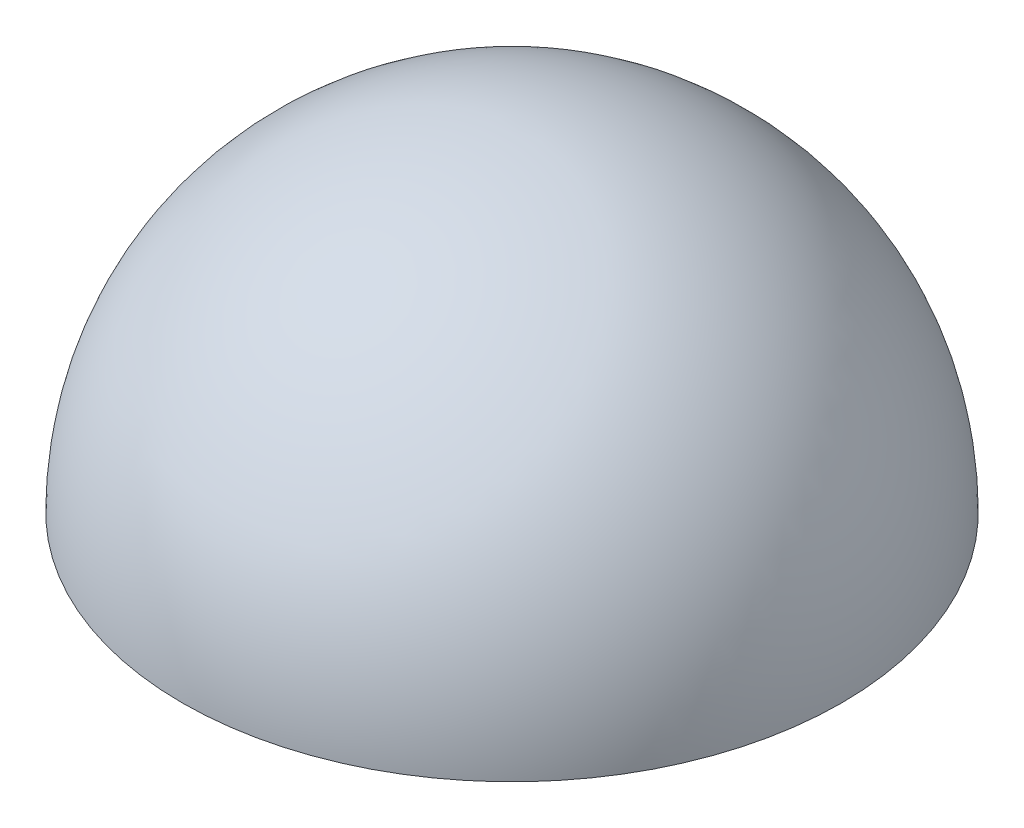
ISO-10303-21;
HEADER;
FILE_DESCRIPTION(('STEP AP214'),'2;1');
FILE_NAME('part.step','',(''),(''),'','','');
FILE_SCHEMA(('AUTOMOTIVE_DESIGN { 1 0 10303 214 1 1 1 1 }'));
ENDSEC;
DATA;
#1=APPLICATION_CONTEXT('core data for automotive mechanical design processes');
#2=APPLICATION_PROTOCOL_DEFINITION('international standard','automotive_design',2000,#1);
#3=PRODUCT_CONTEXT('',#1,'mechanical');
#4=PRODUCT('Part','Part','',(#3));
#5=PRODUCT_RELATED_PRODUCT_CATEGORY('part','',(#4));
#6=PRODUCT_DEFINITION_FORMATION('','',#4);
#7=PRODUCT_DEFINITION_CONTEXT('part definition',#1,'design');
#8=PRODUCT_DEFINITION('design','',#6,#7);
#9=PRODUCT_DEFINITION_SHAPE('','',#8);
#10=(LENGTH_UNIT() NAMED_UNIT(*) SI_UNIT(.MILLI.,.METRE.));
#11=(NAMED_UNIT(*) PLANE_ANGLE_UNIT() SI_UNIT($,.RADIAN.));
#12=(NAMED_UNIT(*) SI_UNIT($,.STERADIAN.) SOLID_ANGLE_UNIT());
#13=UNCERTAINTY_MEASURE_WITH_UNIT(LENGTH_MEASURE(1.E-05),#10,'distance_accuracy_value','');
#14=(GEOMETRIC_REPRESENTATION_CONTEXT(3) GLOBAL_UNCERTAINTY_ASSIGNED_CONTEXT((#13)) GLOBAL_UNIT_ASSIGNED_CONTEXT((#10,
#11,#12)) REPRESENTATION_CONTEXT('',''));
#15=CARTESIAN_POINT('',(0.,0.,0.));
#16=DIRECTION('',(0.,0.,1.));
#17=DIRECTION('',(1.,0.,0.));
#18=AXIS2_PLACEMENT_3D('',#15,#16,#17);
#19=CARTESIAN_POINT('',(0.,0.,0.));
#20=DIRECTION('',(0.,-1.,0.));
#21=DIRECTION('',(-1.,0.,0.));
#22=AXIS2_PLACEMENT_3D('',#19,#20,#21);
#23=SPHERICAL_SURFACE('',#22,84.25);
#24=CARTESIAN_POINT('',(0.,-5.88314605595068E-13,0.));
#25=DIRECTION('',(0.,-1.,0.));
#26=DIRECTION('',(0.,0.,-1.));
#27=AXIS2_PLACEMENT_3D('',#24,#25,#26);
#28=CIRCLE('',#27,84.25);
#29=CARTESIAN_POINT('',(0.,-5.88314605595068E-13,-84.25));
#30=VERTEX_POINT('',#29);
#31=EDGE_CURVE('E10',#30,#30,#28,.T.);
#32=ORIENTED_EDGE('',*,*,#31,.F.);
#33=EDGE_LOOP('',(#32));
#34=FACE_BOUND('',#33,.T.);
#35=ADVANCED_FACE('F41',(#34),#23,.T.);
#36=CARTESIAN_POINT('',(-84.25,-5.62128495553745E-13,0.));
#37=DIRECTION('',(0.,1.,0.));
#38=DIRECTION('',(0.,0.,1.));
#39=AXIS2_PLACEMENT_3D('',#36,#37,#38);
#40=PLANE('',#39);
#41=CARTESIAN_POINT('',(0.,-5.35942385512421E-13,0.));
#42=DIRECTION('',(0.,-1.,0.));
#43=DIRECTION('',(0.,0.,-1.));
#44=AXIS2_PLACEMENT_3D('',#41,#42,#43);
#45=CIRCLE('',#44,76.75);
#46=CARTESIAN_POINT('',(0.,-5.35942385512421E-13,-76.75));
#47=VERTEX_POINT('',#46);
#48=EDGE_CURVE('E47',#47,#47,#45,.T.);
#49=ORIENTED_EDGE('',*,*,#48,.F.);
#50=EDGE_LOOP('',(#49));
#51=FACE_BOUND('',#50,.T.);
#52=ORIENTED_EDGE('',*,*,#31,.T.);
#53=EDGE_LOOP('',(#52));
#54=FACE_BOUND('',#53,.T.);
#55=ADVANCED_FACE('F55',(#51,#54),#40,.F.);
#56=CARTESIAN_POINT('',(0.,0.,0.));
#57=DIRECTION('',(0.,-1.,0.));
#58=DIRECTION('',(-1.,0.,0.));
#59=AXIS2_PLACEMENT_3D('',#56,#57,#58);
#60=SPHERICAL_SURFACE('',#59,76.75);
#61=ORIENTED_EDGE('',*,*,#48,.T.);
#62=EDGE_LOOP('',(#61));
#63=FACE_BOUND('',#62,.T.);
#64=ADVANCED_FACE('F53',(#63),#60,.F.);
#65=CLOSED_SHELL('',(#35,#55,#64));
#66=MANIFOLD_SOLID_BREP('B2',#65);
#67=ADVANCED_BREP_SHAPE_REPRESENTATION('',(#18,#66),#14);
#68=SHAPE_DEFINITION_REPRESENTATION(#9,#67);
ENDSEC;
END-ISO-10303-21;
